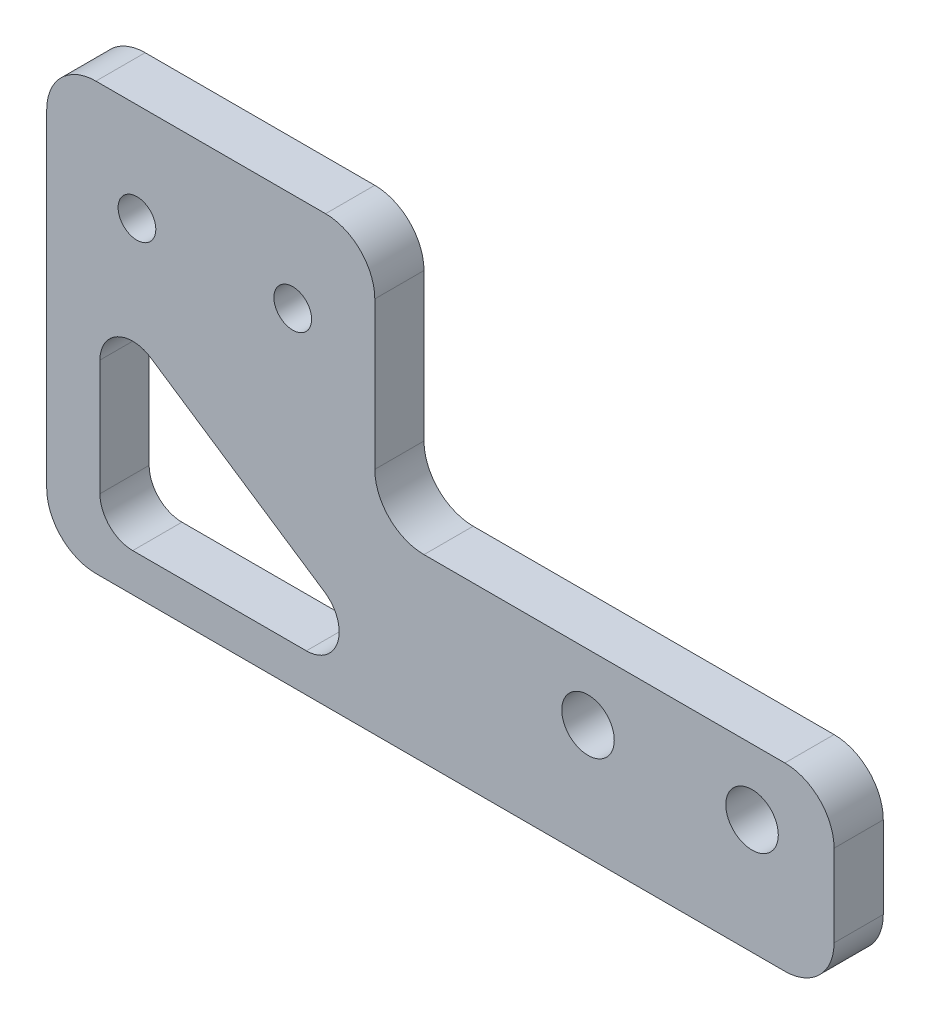
ISO-10303-21;
HEADER;
FILE_DESCRIPTION(('STEP AP214'),'2;1');
FILE_NAME('part.step','',(''),(''),'','','');
FILE_SCHEMA(('AUTOMOTIVE_DESIGN { 1 0 10303 214 1 1 1 1 }'));
ENDSEC;
DATA;
#1=APPLICATION_CONTEXT('core data for automotive mechanical design processes');
#2=APPLICATION_PROTOCOL_DEFINITION('international standard','automotive_design',2000,#1);
#3=PRODUCT_CONTEXT('',#1,'mechanical');
#4=PRODUCT('Part','Part','',(#3));
#5=PRODUCT_RELATED_PRODUCT_CATEGORY('part','',(#4));
#6=PRODUCT_DEFINITION_FORMATION('','',#4);
#7=PRODUCT_DEFINITION_CONTEXT('part definition',#1,'design');
#8=PRODUCT_DEFINITION('design','',#6,#7);
#9=PRODUCT_DEFINITION_SHAPE('','',#8);
#10=(LENGTH_UNIT() NAMED_UNIT(*) SI_UNIT(.MILLI.,.METRE.));
#11=(NAMED_UNIT(*) PLANE_ANGLE_UNIT() SI_UNIT($,.RADIAN.));
#12=(NAMED_UNIT(*) SI_UNIT($,.STERADIAN.) SOLID_ANGLE_UNIT());
#13=UNCERTAINTY_MEASURE_WITH_UNIT(LENGTH_MEASURE(1.E-05),#10,'distance_accuracy_value','');
#14=(GEOMETRIC_REPRESENTATION_CONTEXT(3) GLOBAL_UNCERTAINTY_ASSIGNED_CONTEXT((#13)) GLOBAL_UNIT_ASSIGNED_CONTEXT((#10,
#11,#12)) REPRESENTATION_CONTEXT('',''));
#15=CARTESIAN_POINT('',(0.,0.,0.));
#16=DIRECTION('',(0.,0.,1.));
#17=DIRECTION('',(1.,0.,0.));
#18=AXIS2_PLACEMENT_3D('',#15,#16,#17);
#19=CARTESIAN_POINT('',(0.,0.,3.));
#20=DIRECTION('',(0.,0.,-1.));
#21=DIRECTION('',(-1.,0.,0.));
#22=AXIS2_PLACEMENT_3D('',#19,#20,#21);
#23=PLANE('',#22);
#24=DIRECTION('',(0.,-1.,0.));
#25=VECTOR('',#24,1.);
#26=CARTESIAN_POINT('',(3.24319911624979,15.1276437616448,3.));
#27=LINE('',#26,#25);
#28=CARTESIAN_POINT('',(3.24319911624979,11.390921856379,3.));
#29=VERTEX_POINT('',#28);
#30=CARTESIAN_POINT('',(3.24319911624979,4.33475934490726,3.));
#31=VERTEX_POINT('',#30);
#32=EDGE_CURVE('E272',#29,#31,#27,.T.);
#33=ORIENTED_EDGE('',*,*,#32,.F.);
#34=CARTESIAN_POINT('',(5.24319911624979,11.390921856379,3.));
#35=DIRECTION('',(0.,0.,-1.));
#36=DIRECTION('',(-1.,0.,0.));
#37=AXIS2_PLACEMENT_3D('',#34,#35,#36);
#38=CIRCLE('',#37,2.);
#39=CARTESIAN_POINT('',(6.35248379566843,13.0550995812651,3.));
#40=VERTEX_POINT('',#39);
#41=EDGE_CURVE('E42',#29,#40,#38,.T.);
#42=ORIENTED_EDGE('',*,*,#41,.T.);
#43=DIRECTION('',(-0.832088862443053,0.554642339709317,0.));
#44=VECTOR('',#43,1.);
#45=CARTESIAN_POINT('',(22.4354170188128,2.33475934490726,3.));
#46=LINE('',#45,#44);
#47=CARTESIAN_POINT('',(16.9383223028061,5.99893706979336,3.));
#48=VERTEX_POINT('',#47);
#49=EDGE_CURVE('E271',#48,#40,#46,.T.);
#50=ORIENTED_EDGE('',*,*,#49,.F.);
#51=CARTESIAN_POINT('',(15.8290376233875,4.33475934490726,3.));
#52=DIRECTION('',(0.,0.,-1.));
#53=DIRECTION('',(-1.,0.,0.));
#54=AXIS2_PLACEMENT_3D('',#51,#52,#53);
#55=CIRCLE('',#54,2.);
#56=CARTESIAN_POINT('',(15.8290376233875,2.33475934490726,3.));
#57=VERTEX_POINT('',#56);
#58=EDGE_CURVE('E263',#48,#57,#55,.T.);
#59=ORIENTED_EDGE('',*,*,#58,.T.);
#60=DIRECTION('',(1.,0.,0.));
#61=VECTOR('',#60,1.);
#62=CARTESIAN_POINT('',(3.24319911624979,2.33475934490726,3.));
#63=LINE('',#62,#61);
#64=CARTESIAN_POINT('',(5.24319911624979,2.33475934490726,3.));
#65=VERTEX_POINT('',#64);
#66=EDGE_CURVE('E296',#65,#57,#63,.T.);
#67=ORIENTED_EDGE('',*,*,#66,.F.);
#68=CARTESIAN_POINT('',(5.24319911624979,4.33475934490726,3.));
#69=DIRECTION('',(0.,0.,-1.));
#70=DIRECTION('',(-1.,0.,0.));
#71=AXIS2_PLACEMENT_3D('',#68,#69,#70);
#72=CIRCLE('',#71,2.);
#73=EDGE_CURVE('E49',#65,#31,#72,.T.);
#74=ORIENTED_EDGE('',*,*,#73,.T.);
#75=EDGE_LOOP('',(#33,#42,#50,#59,#67,#74));
#76=FACE_BOUND('',#75,.T.);
#77=DIRECTION('',(0.,-1.,0.));
#78=VECTOR('',#77,1.);
#79=CARTESIAN_POINT('',(20.,11.,3.));
#80=LINE('',#79,#78);
#81=CARTESIAN_POINT('',(20.,23.,3.));
#82=VERTEX_POINT('',#81);
#83=CARTESIAN_POINT('',(20.,14.,3.));
#84=VERTEX_POINT('',#83);
#85=EDGE_CURVE('E160',#82,#84,#80,.T.);
#86=ORIENTED_EDGE('',*,*,#85,.F.);
#87=CARTESIAN_POINT('',(17.,23.,3.));
#88=DIRECTION('',(0.,0.,-1.));
#89=DIRECTION('',(-1.,0.,0.));
#90=AXIS2_PLACEMENT_3D('',#87,#88,#89);
#91=CIRCLE('',#90,3.);
#92=CARTESIAN_POINT('',(17.,26.,3.));
#93=VERTEX_POINT('',#92);
#94=EDGE_CURVE('E227',#82,#93,#91,.F.);
#95=ORIENTED_EDGE('',*,*,#94,.T.);
#96=DIRECTION('',(1.,0.,0.));
#97=VECTOR('',#96,1.);
#98=CARTESIAN_POINT('',(-5.74665590419343,26.,3.));
#99=LINE('',#98,#97);
#100=CARTESIAN_POINT('',(3.,26.,3.));
#101=VERTEX_POINT('',#100);
#102=EDGE_CURVE('E299',#101,#93,#99,.T.);
#103=ORIENTED_EDGE('',*,*,#102,.F.);
#104=CARTESIAN_POINT('',(3.,23.,3.));
#105=DIRECTION('',(0.,0.,-1.));
#106=DIRECTION('',(-1.,0.,0.));
#107=AXIS2_PLACEMENT_3D('',#104,#105,#106);
#108=CIRCLE('',#107,3.);
#109=CARTESIAN_POINT('',(0.,23.,3.));
#110=VERTEX_POINT('',#109);
#111=EDGE_CURVE('E225',#101,#110,#108,.F.);
#112=ORIENTED_EDGE('',*,*,#111,.T.);
#113=DIRECTION('',(0.,-1.,0.));
#114=VECTOR('',#113,1.);
#115=CARTESIAN_POINT('',(0.,0.,3.));
#116=LINE('',#115,#114);
#117=CARTESIAN_POINT('',(0.,3.,3.));
#118=VERTEX_POINT('',#117);
#119=EDGE_CURVE('E338',#110,#118,#116,.T.);
#120=ORIENTED_EDGE('',*,*,#119,.T.);
#121=CARTESIAN_POINT('',(3.,3.,3.));
#122=DIRECTION('',(0.,0.,-1.));
#123=DIRECTION('',(-1.,0.,0.));
#124=AXIS2_PLACEMENT_3D('',#121,#122,#123);
#125=CIRCLE('',#124,3.);
#126=CARTESIAN_POINT('',(3.,0.,3.));
#127=VERTEX_POINT('',#126);
#128=EDGE_CURVE('E197',#118,#127,#125,.F.);
#129=ORIENTED_EDGE('',*,*,#128,.T.);
#130=DIRECTION('',(1.,0.,0.));
#131=VECTOR('',#130,1.);
#132=CARTESIAN_POINT('',(0.,0.,3.));
#133=LINE('',#132,#131);
#134=CARTESIAN_POINT('',(45.,0.,3.));
#135=VERTEX_POINT('',#134);
#136=EDGE_CURVE('E190',#127,#135,#133,.T.);
#137=ORIENTED_EDGE('',*,*,#136,.T.);
#138=CARTESIAN_POINT('',(45.,3.,3.));
#139=DIRECTION('',(0.,0.,-1.));
#140=DIRECTION('',(-1.,0.,0.));
#141=AXIS2_PLACEMENT_3D('',#138,#139,#140);
#142=CIRCLE('',#141,3.);
#143=CARTESIAN_POINT('',(48.,3.,3.));
#144=VERTEX_POINT('',#143);
#145=EDGE_CURVE('E187',#135,#144,#142,.F.);
#146=ORIENTED_EDGE('',*,*,#145,.T.);
#147=DIRECTION('',(0.,1.,0.));
#148=VECTOR('',#147,1.);
#149=CARTESIAN_POINT('',(48.,0.,3.));
#150=LINE('',#149,#148);
#151=CARTESIAN_POINT('',(48.,8.,3.));
#152=VERTEX_POINT('',#151);
#153=EDGE_CURVE('E185',#144,#152,#150,.T.);
#154=ORIENTED_EDGE('',*,*,#153,.T.);
#155=CARTESIAN_POINT('',(45.,8.,3.));
#156=DIRECTION('',(0.,0.,-1.));
#157=DIRECTION('',(-1.,0.,0.));
#158=AXIS2_PLACEMENT_3D('',#155,#156,#157);
#159=CIRCLE('',#158,3.);
#160=CARTESIAN_POINT('',(45.,11.,3.));
#161=VERTEX_POINT('',#160);
#162=EDGE_CURVE('E184',#152,#161,#159,.F.);
#163=ORIENTED_EDGE('',*,*,#162,.T.);
#164=DIRECTION('',(1.,0.,0.));
#165=VECTOR('',#164,1.);
#166=CARTESIAN_POINT('',(48.,11.,3.));
#167=LINE('',#166,#165);
#168=CARTESIAN_POINT('',(23.,11.,3.));
#169=VERTEX_POINT('',#168);
#170=EDGE_CURVE('E170',#169,#161,#167,.T.);
#171=ORIENTED_EDGE('',*,*,#170,.F.);
#172=CARTESIAN_POINT('',(23.,14.,3.));
#173=DIRECTION('',(0.,0.,-1.));
#174=DIRECTION('',(-1.,0.,0.));
#175=AXIS2_PLACEMENT_3D('',#172,#173,#174);
#176=CIRCLE('',#175,3.);
#177=EDGE_CURVE('E174',#169,#84,#176,.T.);
#178=ORIENTED_EDGE('',*,*,#177,.T.);
#179=EDGE_LOOP('',(#86,#95,#103,#112,#120,#129,#137,#146,#154,#163,#171,#178));
#180=FACE_BOUND('',#179,.T.);
#181=CARTESIAN_POINT('',(33.,7.,3.));
#182=DIRECTION('',(0.,0.,1.));
#183=DIRECTION('',(1.,0.,0.));
#184=AXIS2_PLACEMENT_3D('',#181,#182,#183);
#185=CIRCLE('',#184,1.60000000000001);
#186=CARTESIAN_POINT('',(34.6,7.,3.));
#187=VERTEX_POINT('',#186);
#188=EDGE_CURVE('E332',#187,#187,#185,.T.);
#189=ORIENTED_EDGE('',*,*,#188,.F.);
#190=EDGE_LOOP('',(#189));
#191=FACE_BOUND('',#190,.T.);
#192=CARTESIAN_POINT('',(43.,7.,3.));
#193=DIRECTION('',(0.,0.,1.));
#194=DIRECTION('',(1.,0.,0.));
#195=AXIS2_PLACEMENT_3D('',#192,#193,#194);
#196=CIRCLE('',#195,1.6);
#197=CARTESIAN_POINT('',(44.6,7.,3.));
#198=VERTEX_POINT('',#197);
#199=EDGE_CURVE('E326',#198,#198,#196,.T.);
#200=ORIENTED_EDGE('',*,*,#199,.F.);
#201=EDGE_LOOP('',(#200));
#202=FACE_BOUND('',#201,.T.);
#203=CARTESIAN_POINT('',(5.49999999999999,20.,3.));
#204=DIRECTION('',(0.,0.,1.));
#205=DIRECTION('',(1.,0.,0.));
#206=AXIS2_PLACEMENT_3D('',#203,#204,#205);
#207=CIRCLE('',#206,1.15);
#208=CARTESIAN_POINT('',(6.64999999999999,20.,3.));
#209=VERTEX_POINT('',#208);
#210=EDGE_CURVE('E320',#209,#209,#207,.T.);
#211=ORIENTED_EDGE('',*,*,#210,.F.);
#212=EDGE_LOOP('',(#211));
#213=FACE_BOUND('',#212,.T.);
#214=CARTESIAN_POINT('',(15.,20.,3.));
#215=DIRECTION('',(0.,0.,1.));
#216=DIRECTION('',(1.,0.,0.));
#217=AXIS2_PLACEMENT_3D('',#214,#215,#216);
#218=CIRCLE('',#217,1.15);
#219=CARTESIAN_POINT('',(16.15,20.,3.));
#220=VERTEX_POINT('',#219);
#221=EDGE_CURVE('E314',#220,#220,#218,.T.);
#222=ORIENTED_EDGE('',*,*,#221,.F.);
#223=EDGE_LOOP('',(#222));
#224=FACE_BOUND('',#223,.T.);
#225=ADVANCED_FACE('F34',(#76,#180,#191,#202,#213,#224),#23,.F.);
#226=CARTESIAN_POINT('',(0.,0.,0.));
#227=DIRECTION('',(0.,0.,-1.));
#228=DIRECTION('',(-1.,0.,0.));
#229=AXIS2_PLACEMENT_3D('',#226,#227,#228);
#230=PLANE('',#229);
#231=DIRECTION('',(0.832088862443054,-0.554642339709317,0.));
#232=VECTOR('',#231,1.);
#233=CARTESIAN_POINT('',(7.97928405695574,11.9707294570083,0.));
#234=LINE('',#233,#232);
#235=CARTESIAN_POINT('',(6.35248379566843,13.0550995812651,0.));
#236=VERTEX_POINT('',#235);
#237=CARTESIAN_POINT('',(16.9383223028061,5.99893706979336,0.));
#238=VERTEX_POINT('',#237);
#239=EDGE_CURVE('E246',#236,#238,#234,.T.);
#240=ORIENTED_EDGE('',*,*,#239,.F.);
#241=CARTESIAN_POINT('',(5.24319911624979,11.390921856379,0.));
#242=DIRECTION('',(0.,0.,-1.));
#243=DIRECTION('',(-1.,0.,0.));
#244=AXIS2_PLACEMENT_3D('',#241,#242,#243);
#245=CIRCLE('',#244,2.);
#246=CARTESIAN_POINT('',(3.24319911624979,11.390921856379,0.));
#247=VERTEX_POINT('',#246);
#248=EDGE_CURVE('E11',#236,#247,#245,.F.);
#249=ORIENTED_EDGE('',*,*,#248,.T.);
#250=DIRECTION('',(0.,1.,0.));
#251=VECTOR('',#250,1.);
#252=CARTESIAN_POINT('',(3.24319911624979,0.,0.));
#253=LINE('',#252,#251);
#254=CARTESIAN_POINT('',(3.24319911624979,4.33475934490726,0.));
#255=VERTEX_POINT('',#254);
#256=EDGE_CURVE('E240',#255,#247,#253,.T.);
#257=ORIENTED_EDGE('',*,*,#256,.F.);
#258=CARTESIAN_POINT('',(5.24319911624979,4.33475934490726,0.));
#259=DIRECTION('',(0.,0.,-1.));
#260=DIRECTION('',(-1.,0.,0.));
#261=AXIS2_PLACEMENT_3D('',#258,#259,#260);
#262=CIRCLE('',#261,2.);
#263=CARTESIAN_POINT('',(5.24319911624979,2.33475934490726,0.));
#264=VERTEX_POINT('',#263);
#265=EDGE_CURVE('E268',#255,#264,#262,.F.);
#266=ORIENTED_EDGE('',*,*,#265,.T.);
#267=DIRECTION('',(-1.,0.,0.));
#268=VECTOR('',#267,1.);
#269=CARTESIAN_POINT('',(0.,2.33475934490726,0.));
#270=LINE('',#269,#268);
#271=CARTESIAN_POINT('',(15.8290376233875,2.33475934490726,0.));
#272=VERTEX_POINT('',#271);
#273=EDGE_CURVE('E243',#272,#264,#270,.T.);
#274=ORIENTED_EDGE('',*,*,#273,.F.);
#275=CARTESIAN_POINT('',(15.8290376233875,4.33475934490726,0.));
#276=DIRECTION('',(0.,0.,-1.));
#277=DIRECTION('',(-1.,0.,0.));
#278=AXIS2_PLACEMENT_3D('',#275,#276,#277);
#279=CIRCLE('',#278,2.);
#280=EDGE_CURVE('E265',#272,#238,#279,.F.);
#281=ORIENTED_EDGE('',*,*,#280,.T.);
#282=EDGE_LOOP('',(#240,#249,#257,#266,#274,#281));
#283=FACE_BOUND('',#282,.T.);
#284=DIRECTION('',(-1.,0.,0.));
#285=VECTOR('',#284,1.);
#286=CARTESIAN_POINT('',(0.,26.,0.));
#287=LINE('',#286,#285);
#288=CARTESIAN_POINT('',(17.,26.,0.));
#289=VERTEX_POINT('',#288);
#290=CARTESIAN_POINT('',(3.,26.,0.));
#291=VERTEX_POINT('',#290);
#292=EDGE_CURVE('E171',#289,#291,#287,.T.);
#293=ORIENTED_EDGE('',*,*,#292,.F.);
#294=CARTESIAN_POINT('',(17.,23.,0.));
#295=DIRECTION('',(0.,0.,-1.));
#296=DIRECTION('',(-1.,0.,0.));
#297=AXIS2_PLACEMENT_3D('',#294,#295,#296);
#298=CIRCLE('',#297,3.);
#299=CARTESIAN_POINT('',(20.,23.,0.));
#300=VERTEX_POINT('',#299);
#301=EDGE_CURVE('E235',#289,#300,#298,.T.);
#302=ORIENTED_EDGE('',*,*,#301,.T.);
#303=DIRECTION('',(0.,-1.,0.));
#304=VECTOR('',#303,1.);
#305=CARTESIAN_POINT('',(20.,11.,0.));
#306=LINE('',#305,#304);
#307=CARTESIAN_POINT('',(20.,14.,0.));
#308=VERTEX_POINT('',#307);
#309=EDGE_CURVE('E307',#300,#308,#306,.T.);
#310=ORIENTED_EDGE('',*,*,#309,.T.);
#311=CARTESIAN_POINT('',(23.,14.,0.));
#312=DIRECTION('',(0.,0.,-1.));
#313=DIRECTION('',(-1.,0.,0.));
#314=AXIS2_PLACEMENT_3D('',#311,#312,#313);
#315=CIRCLE('',#314,3.);
#316=CARTESIAN_POINT('',(23.,11.,0.));
#317=VERTEX_POINT('',#316);
#318=EDGE_CURVE('E180',#308,#317,#315,.F.);
#319=ORIENTED_EDGE('',*,*,#318,.T.);
#320=DIRECTION('',(1.,0.,0.));
#321=VECTOR('',#320,1.);
#322=CARTESIAN_POINT('',(48.,11.,0.));
#323=LINE('',#322,#321);
#324=CARTESIAN_POINT('',(45.,11.,0.));
#325=VERTEX_POINT('',#324);
#326=EDGE_CURVE('E309',#317,#325,#323,.T.);
#327=ORIENTED_EDGE('',*,*,#326,.T.);
#328=CARTESIAN_POINT('',(45.,8.,0.));
#329=DIRECTION('',(0.,0.,-1.));
#330=DIRECTION('',(-1.,0.,0.));
#331=AXIS2_PLACEMENT_3D('',#328,#329,#330);
#332=CIRCLE('',#331,3.);
#333=CARTESIAN_POINT('',(48.,8.,0.));
#334=VERTEX_POINT('',#333);
#335=EDGE_CURVE('E199',#325,#334,#332,.T.);
#336=ORIENTED_EDGE('',*,*,#335,.T.);
#337=DIRECTION('',(0.,1.,0.));
#338=VECTOR('',#337,1.);
#339=CARTESIAN_POINT('',(48.,0.,0.));
#340=LINE('',#339,#338);
#341=CARTESIAN_POINT('',(48.,3.,0.));
#342=VERTEX_POINT('',#341);
#343=EDGE_CURVE('E193',#342,#334,#340,.T.);
#344=ORIENTED_EDGE('',*,*,#343,.F.);
#345=CARTESIAN_POINT('',(45.,3.,0.));
#346=DIRECTION('',(0.,0.,-1.));
#347=DIRECTION('',(-1.,0.,0.));
#348=AXIS2_PLACEMENT_3D('',#345,#346,#347);
#349=CIRCLE('',#348,3.);
#350=CARTESIAN_POINT('',(45.,0.,0.));
#351=VERTEX_POINT('',#350);
#352=EDGE_CURVE('E201',#342,#351,#349,.T.);
#353=ORIENTED_EDGE('',*,*,#352,.T.);
#354=DIRECTION('',(1.,0.,0.));
#355=VECTOR('',#354,1.);
#356=CARTESIAN_POINT('',(0.,0.,0.));
#357=LINE('',#356,#355);
#358=CARTESIAN_POINT('',(3.,0.,0.));
#359=VERTEX_POINT('',#358);
#360=EDGE_CURVE('E342',#359,#351,#357,.T.);
#361=ORIENTED_EDGE('',*,*,#360,.F.);
#362=CARTESIAN_POINT('',(3.,3.,0.));
#363=DIRECTION('',(0.,0.,-1.));
#364=DIRECTION('',(-1.,0.,0.));
#365=AXIS2_PLACEMENT_3D('',#362,#363,#364);
#366=CIRCLE('',#365,3.);
#367=CARTESIAN_POINT('',(0.,3.,0.));
#368=VERTEX_POINT('',#367);
#369=EDGE_CURVE('E203',#359,#368,#366,.T.);
#370=ORIENTED_EDGE('',*,*,#369,.T.);
#371=DIRECTION('',(0.,-1.,0.));
#372=VECTOR('',#371,1.);
#373=CARTESIAN_POINT('',(0.,0.,0.));
#374=LINE('',#373,#372);
#375=CARTESIAN_POINT('',(0.,23.,0.));
#376=VERTEX_POINT('',#375);
#377=EDGE_CURVE('E335',#376,#368,#374,.T.);
#378=ORIENTED_EDGE('',*,*,#377,.F.);
#379=CARTESIAN_POINT('',(3.,23.,0.));
#380=DIRECTION('',(0.,0.,-1.));
#381=DIRECTION('',(-1.,0.,0.));
#382=AXIS2_PLACEMENT_3D('',#379,#380,#381);
#383=CIRCLE('',#382,3.);
#384=EDGE_CURVE('E233',#376,#291,#383,.T.);
#385=ORIENTED_EDGE('',*,*,#384,.T.);
#386=EDGE_LOOP('',(#293,#302,#310,#319,#327,#336,#344,#353,#361,#370,#378,#385));
#387=FACE_BOUND('',#386,.T.);
#388=CARTESIAN_POINT('',(5.49999999999999,20.,0.));
#389=DIRECTION('',(0.,0.,1.));
#390=DIRECTION('',(1.,0.,0.));
#391=AXIS2_PLACEMENT_3D('',#388,#389,#390);
#392=CIRCLE('',#391,1.15);
#393=CARTESIAN_POINT('',(6.64999999999999,20.,0.));
#394=VERTEX_POINT('',#393);
#395=EDGE_CURVE('E317',#394,#394,#392,.T.);
#396=ORIENTED_EDGE('',*,*,#395,.T.);
#397=EDGE_LOOP('',(#396));
#398=FACE_BOUND('',#397,.T.);
#399=CARTESIAN_POINT('',(33.,7.,0.));
#400=DIRECTION('',(0.,0.,1.));
#401=DIRECTION('',(1.,0.,0.));
#402=AXIS2_PLACEMENT_3D('',#399,#400,#401);
#403=CIRCLE('',#402,1.60000000000001);
#404=CARTESIAN_POINT('',(34.6,7.,0.));
#405=VERTEX_POINT('',#404);
#406=EDGE_CURVE('E329',#405,#405,#403,.T.);
#407=ORIENTED_EDGE('',*,*,#406,.T.);
#408=EDGE_LOOP('',(#407));
#409=FACE_BOUND('',#408,.T.);
#410=CARTESIAN_POINT('',(43.,7.,0.));
#411=DIRECTION('',(0.,0.,1.));
#412=DIRECTION('',(1.,0.,0.));
#413=AXIS2_PLACEMENT_3D('',#410,#411,#412);
#414=CIRCLE('',#413,1.6);
#415=CARTESIAN_POINT('',(44.6,7.,0.));
#416=VERTEX_POINT('',#415);
#417=EDGE_CURVE('E323',#416,#416,#414,.T.);
#418=ORIENTED_EDGE('',*,*,#417,.T.);
#419=EDGE_LOOP('',(#418));
#420=FACE_BOUND('',#419,.T.);
#421=CARTESIAN_POINT('',(15.,20.,0.));
#422=DIRECTION('',(0.,0.,1.));
#423=DIRECTION('',(1.,0.,0.));
#424=AXIS2_PLACEMENT_3D('',#421,#422,#423);
#425=CIRCLE('',#424,1.15);
#426=CARTESIAN_POINT('',(16.15,20.,0.));
#427=VERTEX_POINT('',#426);
#428=EDGE_CURVE('E311',#427,#427,#425,.T.);
#429=ORIENTED_EDGE('',*,*,#428,.T.);
#430=EDGE_LOOP('',(#429));
#431=FACE_BOUND('',#430,.T.);
#432=ADVANCED_FACE('F281',(#283,#387,#398,#409,#420,#431),#230,.T.);
#433=CARTESIAN_POINT('',(0.,0.,3.));
#434=DIRECTION('',(1.,0.,0.));
#435=DIRECTION('',(0.,0.,-1.));
#436=AXIS2_PLACEMENT_3D('',#433,#434,#435);
#437=PLANE('',#436);
#438=ORIENTED_EDGE('',*,*,#119,.F.);
#439=DIRECTION('',(0.,0.,-1.));
#440=VECTOR('',#439,1.);
#441=CARTESIAN_POINT('',(0.,23.,3.));
#442=LINE('',#441,#440);
#443=EDGE_CURVE('E237',#110,#376,#442,.T.);
#444=ORIENTED_EDGE('',*,*,#443,.T.);
#445=ORIENTED_EDGE('',*,*,#377,.T.);
#446=DIRECTION('',(0.,0.,-1.));
#447=VECTOR('',#446,1.);
#448=CARTESIAN_POINT('',(0.,3.,3.));
#449=LINE('',#448,#447);
#450=EDGE_CURVE('E206',#368,#118,#449,.F.);
#451=ORIENTED_EDGE('',*,*,#450,.T.);
#452=EDGE_LOOP('',(#438,#444,#445,#451));
#453=FACE_BOUND('',#452,.T.);
#454=ADVANCED_FACE('F377',(#453),#437,.F.);
#455=CARTESIAN_POINT('',(0.,0.,3.));
#456=DIRECTION('',(0.,1.,0.));
#457=DIRECTION('',(0.,0.,1.));
#458=AXIS2_PLACEMENT_3D('',#455,#456,#457);
#459=PLANE('',#458);
#460=ORIENTED_EDGE('',*,*,#136,.F.);
#461=DIRECTION('',(0.,0.,-1.));
#462=VECTOR('',#461,1.);
#463=CARTESIAN_POINT('',(3.,0.,3.));
#464=LINE('',#463,#462);
#465=EDGE_CURVE('E211',#127,#359,#464,.T.);
#466=ORIENTED_EDGE('',*,*,#465,.T.);
#467=ORIENTED_EDGE('',*,*,#360,.T.);
#468=DIRECTION('',(0.,0.,-1.));
#469=VECTOR('',#468,1.);
#470=CARTESIAN_POINT('',(45.,0.,3.));
#471=LINE('',#470,#469);
#472=EDGE_CURVE('E209',#351,#135,#471,.F.);
#473=ORIENTED_EDGE('',*,*,#472,.T.);
#474=EDGE_LOOP('',(#460,#466,#467,#473));
#475=FACE_BOUND('',#474,.T.);
#476=ADVANCED_FACE('F386',(#475),#459,.F.);
#477=CARTESIAN_POINT('',(48.,0.,3.));
#478=DIRECTION('',(-1.,0.,0.));
#479=DIRECTION('',(0.,-1.,0.));
#480=AXIS2_PLACEMENT_3D('',#477,#478,#479);
#481=PLANE('',#480);
#482=ORIENTED_EDGE('',*,*,#153,.F.);
#483=DIRECTION('',(0.,0.,-1.));
#484=VECTOR('',#483,1.);
#485=CARTESIAN_POINT('',(48.,3.,3.));
#486=LINE('',#485,#484);
#487=EDGE_CURVE('E217',#144,#342,#486,.T.);
#488=ORIENTED_EDGE('',*,*,#487,.T.);
#489=ORIENTED_EDGE('',*,*,#343,.T.);
#490=DIRECTION('',(0.,0.,1.));
#491=VECTOR('',#490,1.);
#492=CARTESIAN_POINT('',(48.,8.,3.));
#493=LINE('',#492,#491);
#494=EDGE_CURVE('E214',#334,#152,#493,.T.);
#495=ORIENTED_EDGE('',*,*,#494,.T.);
#496=EDGE_LOOP('',(#482,#488,#489,#495));
#497=FACE_BOUND('',#496,.T.);
#498=ADVANCED_FACE('F352',(#497),#481,.F.);
#499=CARTESIAN_POINT('',(33.,7.,3.));
#500=DIRECTION('',(0.,0.,-1.));
#501=DIRECTION('',(-1.,0.,0.));
#502=AXIS2_PLACEMENT_3D('',#499,#500,#501);
#503=CYLINDRICAL_SURFACE('',#502,1.60000000000001);
#504=ORIENTED_EDGE('',*,*,#188,.T.);
#505=EDGE_LOOP('',(#504));
#506=FACE_BOUND('',#505,.T.);
#507=ORIENTED_EDGE('',*,*,#406,.F.);
#508=EDGE_LOOP('',(#507));
#509=FACE_BOUND('',#508,.T.);
#510=ADVANCED_FACE('F404',(#506,#509),#503,.F.);
#511=CARTESIAN_POINT('',(43.,7.,3.));
#512=DIRECTION('',(0.,0.,-1.));
#513=DIRECTION('',(-1.,0.,0.));
#514=AXIS2_PLACEMENT_3D('',#511,#512,#513);
#515=CYLINDRICAL_SURFACE('',#514,1.6);
#516=ORIENTED_EDGE('',*,*,#199,.T.);
#517=EDGE_LOOP('',(#516));
#518=FACE_BOUND('',#517,.T.);
#519=ORIENTED_EDGE('',*,*,#417,.F.);
#520=EDGE_LOOP('',(#519));
#521=FACE_BOUND('',#520,.T.);
#522=ADVANCED_FACE('F434',(#518,#521),#515,.F.);
#523=CARTESIAN_POINT('',(5.49999999999999,20.,3.));
#524=DIRECTION('',(0.,0.,-1.));
#525=DIRECTION('',(-1.,0.,0.));
#526=AXIS2_PLACEMENT_3D('',#523,#524,#525);
#527=CYLINDRICAL_SURFACE('',#526,1.15);
#528=ORIENTED_EDGE('',*,*,#210,.T.);
#529=EDGE_LOOP('',(#528));
#530=FACE_BOUND('',#529,.T.);
#531=ORIENTED_EDGE('',*,*,#395,.F.);
#532=EDGE_LOOP('',(#531));
#533=FACE_BOUND('',#532,.T.);
#534=ADVANCED_FACE('F441',(#530,#533),#527,.F.);
#535=CARTESIAN_POINT('',(15.,20.,3.));
#536=DIRECTION('',(0.,0.,-1.));
#537=DIRECTION('',(-1.,0.,0.));
#538=AXIS2_PLACEMENT_3D('',#535,#536,#537);
#539=CYLINDRICAL_SURFACE('',#538,1.15);
#540=ORIENTED_EDGE('',*,*,#221,.T.);
#541=EDGE_LOOP('',(#540));
#542=FACE_BOUND('',#541,.T.);
#543=ORIENTED_EDGE('',*,*,#428,.F.);
#544=EDGE_LOOP('',(#543));
#545=FACE_BOUND('',#544,.T.);
#546=ADVANCED_FACE('F448',(#542,#545),#539,.F.);
#547=CARTESIAN_POINT('',(48.,11.,0.));
#548=DIRECTION('',(0.,-1.,0.));
#549=DIRECTION('',(1.,0.,0.));
#550=AXIS2_PLACEMENT_3D('',#547,#548,#549);
#551=PLANE('',#550);
#552=ORIENTED_EDGE('',*,*,#170,.T.);
#553=DIRECTION('',(0.,0.,1.));
#554=VECTOR('',#553,1.);
#555=CARTESIAN_POINT('',(45.,11.,0.));
#556=LINE('',#555,#554);
#557=EDGE_CURVE('E181',#161,#325,#556,.F.);
#558=ORIENTED_EDGE('',*,*,#557,.T.);
#559=ORIENTED_EDGE('',*,*,#326,.F.);
#560=DIRECTION('',(0.,0.,1.));
#561=VECTOR('',#560,1.);
#562=CARTESIAN_POINT('',(23.,11.,3.));
#563=LINE('',#562,#561);
#564=EDGE_CURVE('E220',#317,#169,#563,.T.);
#565=ORIENTED_EDGE('',*,*,#564,.T.);
#566=EDGE_LOOP('',(#552,#558,#559,#565));
#567=FACE_BOUND('',#566,.T.);
#568=ADVANCED_FACE('F359',(#567),#551,.F.);
#569=CARTESIAN_POINT('',(20.,11.,0.));
#570=DIRECTION('',(-1.,0.,0.));
#571=DIRECTION('',(0.,0.,1.));
#572=AXIS2_PLACEMENT_3D('',#569,#570,#571);
#573=PLANE('',#572);
#574=ORIENTED_EDGE('',*,*,#309,.F.);
#575=DIRECTION('',(0.,0.,1.));
#576=VECTOR('',#575,1.);
#577=CARTESIAN_POINT('',(20.,23.,0.));
#578=LINE('',#577,#576);
#579=EDGE_CURVE('E168',#300,#82,#578,.T.);
#580=ORIENTED_EDGE('',*,*,#579,.T.);
#581=ORIENTED_EDGE('',*,*,#85,.T.);
#582=DIRECTION('',(0.,0.,1.));
#583=VECTOR('',#582,1.);
#584=CARTESIAN_POINT('',(20.,14.,0.));
#585=LINE('',#584,#583);
#586=EDGE_CURVE('E165',#84,#308,#585,.F.);
#587=ORIENTED_EDGE('',*,*,#586,.T.);
#588=EDGE_LOOP('',(#574,#580,#581,#587));
#589=FACE_BOUND('',#588,.T.);
#590=ADVANCED_FACE('F163',(#589),#573,.F.);
#591=CARTESIAN_POINT('',(3.,3.,3.));
#592=DIRECTION('',(0.,0.,-1.));
#593=DIRECTION('',(-1.,0.,0.));
#594=AXIS2_PLACEMENT_3D('',#591,#592,#593);
#595=CYLINDRICAL_SURFACE('',#594,3.);
#596=ORIENTED_EDGE('',*,*,#128,.F.);
#597=ORIENTED_EDGE('',*,*,#450,.F.);
#598=ORIENTED_EDGE('',*,*,#369,.F.);
#599=ORIENTED_EDGE('',*,*,#465,.F.);
#600=EDGE_LOOP('',(#596,#597,#598,#599));
#601=FACE_BOUND('',#600,.T.);
#602=ADVANCED_FACE('F383',(#601),#595,.T.);
#603=CARTESIAN_POINT('',(45.,3.,3.));
#604=DIRECTION('',(0.,0.,-1.));
#605=DIRECTION('',(-1.,0.,0.));
#606=AXIS2_PLACEMENT_3D('',#603,#604,#605);
#607=CYLINDRICAL_SURFACE('',#606,3.);
#608=ORIENTED_EDGE('',*,*,#145,.F.);
#609=ORIENTED_EDGE('',*,*,#472,.F.);
#610=ORIENTED_EDGE('',*,*,#352,.F.);
#611=ORIENTED_EDGE('',*,*,#487,.F.);
#612=EDGE_LOOP('',(#608,#609,#610,#611));
#613=FACE_BOUND('',#612,.T.);
#614=ADVANCED_FACE('F388',(#613),#607,.T.);
#615=CARTESIAN_POINT('',(45.,8.,3.));
#616=DIRECTION('',(0.,0.,1.));
#617=DIRECTION('',(1.,0.,0.));
#618=AXIS2_PLACEMENT_3D('',#615,#616,#617);
#619=CYLINDRICAL_SURFACE('',#618,3.);
#620=ORIENTED_EDGE('',*,*,#335,.F.);
#621=ORIENTED_EDGE('',*,*,#557,.F.);
#622=ORIENTED_EDGE('',*,*,#162,.F.);
#623=ORIENTED_EDGE('',*,*,#494,.F.);
#624=EDGE_LOOP('',(#620,#621,#622,#623));
#625=FACE_BOUND('',#624,.T.);
#626=ADVANCED_FACE('F356',(#625),#619,.T.);
#627=CARTESIAN_POINT('',(23.,14.,0.));
#628=DIRECTION('',(0.,0.,-1.));
#629=DIRECTION('',(-1.,0.,0.));
#630=AXIS2_PLACEMENT_3D('',#627,#628,#629);
#631=CYLINDRICAL_SURFACE('',#630,3.);
#632=ORIENTED_EDGE('',*,*,#318,.F.);
#633=ORIENTED_EDGE('',*,*,#586,.F.);
#634=ORIENTED_EDGE('',*,*,#177,.F.);
#635=ORIENTED_EDGE('',*,*,#564,.F.);
#636=EDGE_LOOP('',(#632,#633,#634,#635));
#637=FACE_BOUND('',#636,.T.);
#638=ADVANCED_FACE('F183',(#637),#631,.F.);
#639=CARTESIAN_POINT('',(-5.74665590419343,26.,-7.));
#640=DIRECTION('',(0.,-1.,0.));
#641=DIRECTION('',(0.,0.,-1.));
#642=AXIS2_PLACEMENT_3D('',#639,#640,#641);
#643=PLANE('',#642);
#644=ORIENTED_EDGE('',*,*,#102,.T.);
#645=DIRECTION('',(0.,0.,1.));
#646=VECTOR('',#645,1.);
#647=CARTESIAN_POINT('',(17.,26.,-7.));
#648=LINE('',#647,#646);
#649=EDGE_CURVE('E231',#93,#289,#648,.F.);
#650=ORIENTED_EDGE('',*,*,#649,.T.);
#651=ORIENTED_EDGE('',*,*,#292,.T.);
#652=DIRECTION('',(0.,0.,-1.));
#653=VECTOR('',#652,1.);
#654=CARTESIAN_POINT('',(3.,26.,-7.));
#655=LINE('',#654,#653);
#656=EDGE_CURVE('E229',#291,#101,#655,.F.);
#657=ORIENTED_EDGE('',*,*,#656,.T.);
#658=EDGE_LOOP('',(#644,#650,#651,#657));
#659=FACE_BOUND('',#658,.T.);
#660=ADVANCED_FACE('F370',(#659),#643,.F.);
#661=CARTESIAN_POINT('',(17.,23.,0.));
#662=DIRECTION('',(0.,0.,1.));
#663=DIRECTION('',(1.,0.,0.));
#664=AXIS2_PLACEMENT_3D('',#661,#662,#663);
#665=CYLINDRICAL_SURFACE('',#664,3.);
#666=ORIENTED_EDGE('',*,*,#301,.F.);
#667=ORIENTED_EDGE('',*,*,#649,.F.);
#668=ORIENTED_EDGE('',*,*,#94,.F.);
#669=ORIENTED_EDGE('',*,*,#579,.F.);
#670=EDGE_LOOP('',(#666,#667,#668,#669));
#671=FACE_BOUND('',#670,.T.);
#672=ADVANCED_FACE('F365',(#671),#665,.T.);
#673=CARTESIAN_POINT('',(3.,23.,3.));
#674=DIRECTION('',(0.,0.,-1.));
#675=DIRECTION('',(-1.,0.,0.));
#676=AXIS2_PLACEMENT_3D('',#673,#674,#675);
#677=CYLINDRICAL_SURFACE('',#676,3.);
#678=ORIENTED_EDGE('',*,*,#111,.F.);
#679=ORIENTED_EDGE('',*,*,#656,.F.);
#680=ORIENTED_EDGE('',*,*,#384,.F.);
#681=ORIENTED_EDGE('',*,*,#443,.F.);
#682=EDGE_LOOP('',(#678,#679,#680,#681));
#683=FACE_BOUND('',#682,.T.);
#684=ADVANCED_FACE('F373',(#683),#677,.T.);
#685=CARTESIAN_POINT('',(22.4354170188128,2.33475934490726,-7.));
#686=DIRECTION('',(0.554642339709317,0.832088862443053,0.));
#687=DIRECTION('',(-0.832088862443054,0.554642339709317,0.));
#688=AXIS2_PLACEMENT_3D('',#685,#686,#687);
#689=PLANE('',#688);
#690=ORIENTED_EDGE('',*,*,#239,.T.);
#691=DIRECTION('',(0.,0.,1.));
#692=VECTOR('',#691,1.);
#693=CARTESIAN_POINT('',(16.9383223028061,5.99893706979336,3.));
#694=LINE('',#693,#692);
#695=EDGE_CURVE('E251',#238,#48,#694,.T.);
#696=ORIENTED_EDGE('',*,*,#695,.T.);
#697=ORIENTED_EDGE('',*,*,#49,.T.);
#698=DIRECTION('',(0.,0.,1.));
#699=VECTOR('',#698,1.);
#700=CARTESIAN_POINT('',(6.35248379566843,13.0550995812651,0.));
#701=LINE('',#700,#699);
#702=EDGE_CURVE('E249',#40,#236,#701,.F.);
#703=ORIENTED_EDGE('',*,*,#702,.T.);
#704=EDGE_LOOP('',(#690,#696,#697,#703));
#705=FACE_BOUND('',#704,.T.);
#706=ADVANCED_FACE('F274',(#705),#689,.F.);
#707=CARTESIAN_POINT('',(3.24319911624979,2.33475934490726,-7.));
#708=DIRECTION('',(0.,-1.,0.));
#709=DIRECTION('',(0.,0.,-1.));
#710=AXIS2_PLACEMENT_3D('',#707,#708,#709);
#711=PLANE('',#710);
#712=ORIENTED_EDGE('',*,*,#66,.T.);
#713=DIRECTION('',(0.,0.,1.));
#714=VECTOR('',#713,1.);
#715=CARTESIAN_POINT('',(15.8290376233875,2.33475934490726,0.));
#716=LINE('',#715,#714);
#717=EDGE_CURVE('E257',#57,#272,#716,.F.);
#718=ORIENTED_EDGE('',*,*,#717,.T.);
#719=ORIENTED_EDGE('',*,*,#273,.T.);
#720=DIRECTION('',(0.,0.,1.));
#721=VECTOR('',#720,1.);
#722=CARTESIAN_POINT('',(5.24319911624979,2.33475934490726,3.));
#723=LINE('',#722,#721);
#724=EDGE_CURVE('E254',#264,#65,#723,.T.);
#725=ORIENTED_EDGE('',*,*,#724,.T.);
#726=EDGE_LOOP('',(#712,#718,#719,#725));
#727=FACE_BOUND('',#726,.T.);
#728=ADVANCED_FACE('F294',(#727),#711,.F.);
#729=CARTESIAN_POINT('',(3.24319911624979,15.1276437616448,-7.));
#730=DIRECTION('',(-1.,0.,0.));
#731=DIRECTION('',(0.,0.,1.));
#732=AXIS2_PLACEMENT_3D('',#729,#730,#731);
#733=PLANE('',#732);
#734=ORIENTED_EDGE('',*,*,#32,.T.);
#735=DIRECTION('',(0.,0.,1.));
#736=VECTOR('',#735,1.);
#737=CARTESIAN_POINT('',(3.24319911624979,4.33475934490726,0.));
#738=LINE('',#737,#736);
#739=EDGE_CURVE('E261',#31,#255,#738,.F.);
#740=ORIENTED_EDGE('',*,*,#739,.T.);
#741=ORIENTED_EDGE('',*,*,#256,.T.);
#742=DIRECTION('',(0.,0.,1.));
#743=VECTOR('',#742,1.);
#744=CARTESIAN_POINT('',(3.24319911624979,11.390921856379,3.));
#745=LINE('',#744,#743);
#746=EDGE_CURVE('E259',#247,#29,#745,.T.);
#747=ORIENTED_EDGE('',*,*,#746,.T.);
#748=EDGE_LOOP('',(#734,#740,#741,#747));
#749=FACE_BOUND('',#748,.T.);
#750=ADVANCED_FACE('F285',(#749),#733,.F.);
#751=CARTESIAN_POINT('',(15.8290376233875,4.33475934490726,-7.));
#752=DIRECTION('',(0.,0.,-1.));
#753=DIRECTION('',(-1.,0.,0.));
#754=AXIS2_PLACEMENT_3D('',#751,#752,#753);
#755=CYLINDRICAL_SURFACE('',#754,2.);
#756=ORIENTED_EDGE('',*,*,#280,.F.);
#757=ORIENTED_EDGE('',*,*,#717,.F.);
#758=ORIENTED_EDGE('',*,*,#58,.F.);
#759=ORIENTED_EDGE('',*,*,#695,.F.);
#760=EDGE_LOOP('',(#756,#757,#758,#759));
#761=FACE_BOUND('',#760,.T.);
#762=ADVANCED_FACE('F298',(#761),#755,.F.);
#763=CARTESIAN_POINT('',(5.24319911624979,4.33475934490726,-7.));
#764=DIRECTION('',(0.,0.,-1.));
#765=DIRECTION('',(-1.,0.,0.));
#766=AXIS2_PLACEMENT_3D('',#763,#764,#765);
#767=CYLINDRICAL_SURFACE('',#766,2.);
#768=ORIENTED_EDGE('',*,*,#265,.F.);
#769=ORIENTED_EDGE('',*,*,#739,.F.);
#770=ORIENTED_EDGE('',*,*,#73,.F.);
#771=ORIENTED_EDGE('',*,*,#724,.F.);
#772=EDGE_LOOP('',(#768,#769,#770,#771));
#773=FACE_BOUND('',#772,.T.);
#774=ADVANCED_FACE('F288',(#773),#767,.F.);
#775=CARTESIAN_POINT('',(5.24319911624979,11.390921856379,-7.));
#776=DIRECTION('',(0.,0.,-1.));
#777=DIRECTION('',(-1.,0.,0.));
#778=AXIS2_PLACEMENT_3D('',#775,#776,#777);
#779=CYLINDRICAL_SURFACE('',#778,2.);
#780=ORIENTED_EDGE('',*,*,#248,.F.);
#781=ORIENTED_EDGE('',*,*,#702,.F.);
#782=ORIENTED_EDGE('',*,*,#41,.F.);
#783=ORIENTED_EDGE('',*,*,#746,.F.);
#784=EDGE_LOOP('',(#780,#781,#782,#783));
#785=FACE_BOUND('',#784,.T.);
#786=ADVANCED_FACE('F36',(#785),#779,.F.);
#787=CLOSED_SHELL('',(#225,#432,#454,#476,#498,#510,#522,#534,#546,#568,#590,#602,#614,#626,
#638,#660,#672,#684,#706,#728,#750,#762,#774,#786));
#788=MANIFOLD_SOLID_BREP('B2',#787);
#789=ADVANCED_BREP_SHAPE_REPRESENTATION('',(#18,#788),#14);
#790=SHAPE_DEFINITION_REPRESENTATION(#9,#789);
ENDSEC;
END-ISO-10303-21;
